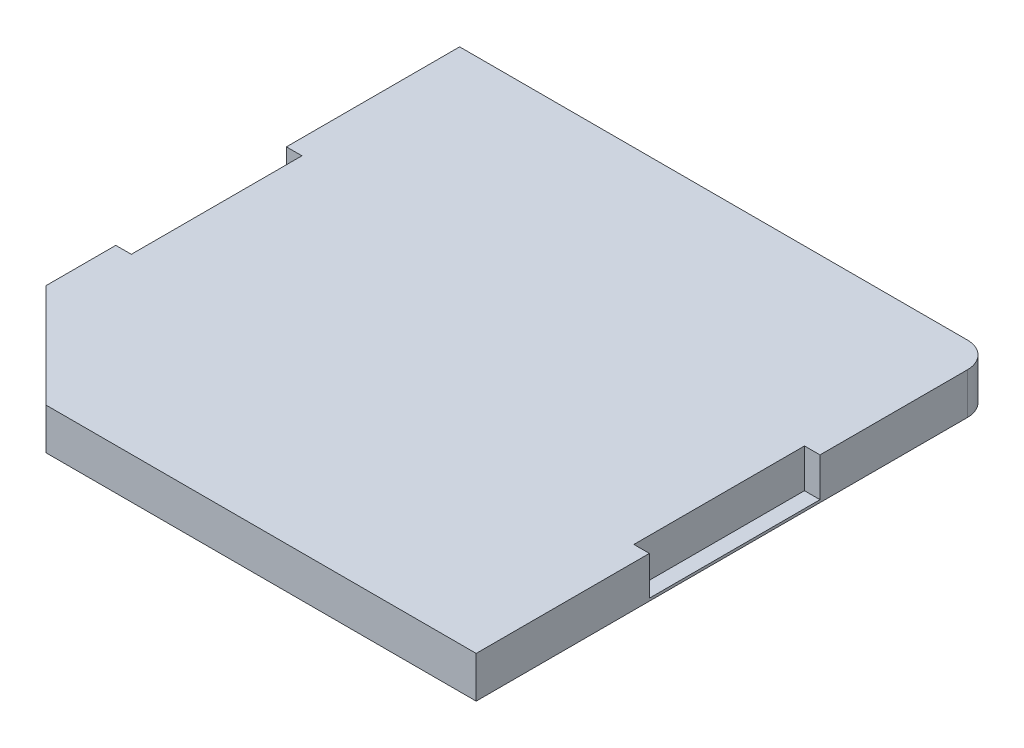
ISO-10303-21;
HEADER;
FILE_DESCRIPTION(('STEP AP214'),'2;1');
FILE_NAME('part.step','',(''),(''),'','','');
FILE_SCHEMA(('AUTOMOTIVE_DESIGN { 1 0 10303 214 1 1 1 1 }'));
ENDSEC;
DATA;
#1=APPLICATION_CONTEXT('core data for automotive mechanical design processes');
#2=APPLICATION_PROTOCOL_DEFINITION('international standard','automotive_design',2000,#1);
#3=PRODUCT_CONTEXT('',#1,'mechanical');
#4=PRODUCT('Part','Part','',(#3));
#5=PRODUCT_RELATED_PRODUCT_CATEGORY('part','',(#4));
#6=PRODUCT_DEFINITION_FORMATION('','',#4);
#7=PRODUCT_DEFINITION_CONTEXT('part definition',#1,'design');
#8=PRODUCT_DEFINITION('design','',#6,#7);
#9=PRODUCT_DEFINITION_SHAPE('','',#8);
#10=(LENGTH_UNIT() NAMED_UNIT(*) SI_UNIT(.MILLI.,.METRE.));
#11=(NAMED_UNIT(*) PLANE_ANGLE_UNIT() SI_UNIT($,.RADIAN.));
#12=(NAMED_UNIT(*) SI_UNIT($,.STERADIAN.) SOLID_ANGLE_UNIT());
#13=UNCERTAINTY_MEASURE_WITH_UNIT(LENGTH_MEASURE(1.E-05),#10,'distance_accuracy_value','');
#14=(GEOMETRIC_REPRESENTATION_CONTEXT(3) GLOBAL_UNCERTAINTY_ASSIGNED_CONTEXT((#13)) GLOBAL_UNIT_ASSIGNED_CONTEXT((#10,
#11,#12)) REPRESENTATION_CONTEXT('',''));
#15=CARTESIAN_POINT('',(0.,0.,0.));
#16=DIRECTION('',(0.,0.,1.));
#17=DIRECTION('',(1.,0.,0.));
#18=AXIS2_PLACEMENT_3D('',#15,#16,#17);
#19=CARTESIAN_POINT('',(28.99,3.22,5.7));
#20=DIRECTION('',(-1.,0.,0.));
#21=DIRECTION('',(0.,0.,1.));
#22=AXIS2_PLACEMENT_3D('',#19,#20,#21);
#23=PLANE('',#22);
#24=DIRECTION('',(0.,1.,0.));
#25=VECTOR('',#24,1.);
#26=CARTESIAN_POINT('',(28.99,1.57,7.35));
#27=LINE('',#26,#25);
#28=CARTESIAN_POINT('',(28.99,2.32,7.35));
#29=VERTEX_POINT('',#28);
#30=CARTESIAN_POINT('',(28.99,1.57,7.35));
#31=VERTEX_POINT('',#30);
#32=EDGE_CURVE('E184',#29,#31,#27,.F.);
#33=ORIENTED_EDGE('',*,*,#32,.T.);
#34=DIRECTION('',(0.,0.,-1.));
#35=VECTOR('',#34,1.);
#36=CARTESIAN_POINT('',(28.99,1.57,4.05));
#37=LINE('',#36,#35);
#38=CARTESIAN_POINT('',(28.99,1.57,4.05));
#39=VERTEX_POINT('',#38);
#40=EDGE_CURVE('E193',#31,#39,#37,.T.);
#41=ORIENTED_EDGE('',*,*,#40,.T.);
#42=DIRECTION('',(0.,1.,0.));
#43=VECTOR('',#42,1.);
#44=CARTESIAN_POINT('',(28.99,4.87,4.05));
#45=LINE('',#44,#43);
#46=CARTESIAN_POINT('',(28.99,2.32,4.05));
#47=VERTEX_POINT('',#46);
#48=EDGE_CURVE('E226',#39,#47,#45,.T.);
#49=ORIENTED_EDGE('',*,*,#48,.T.);
#50=DIRECTION('',(0.,0.,1.));
#51=VECTOR('',#50,1.);
#52=CARTESIAN_POINT('',(28.99,2.32,5.7));
#53=LINE('',#52,#51);
#54=EDGE_CURVE('E153',#29,#47,#53,.F.);
#55=ORIENTED_EDGE('',*,*,#54,.F.);
#56=EDGE_LOOP('',(#33,#41,#49,#55));
#57=FACE_BOUND('',#56,.T.);
#58=ADVANCED_FACE('F17',(#57),#23,.F.);
#59=CARTESIAN_POINT('',(19.27,3.22,5.7));
#60=DIRECTION('',(1.,0.,0.));
#61=DIRECTION('',(0.,0.,-1.));
#62=AXIS2_PLACEMENT_3D('',#59,#60,#61);
#63=PLANE('',#62);
#64=DIRECTION('',(0.,1.,0.));
#65=VECTOR('',#64,1.);
#66=CARTESIAN_POINT('',(19.27,1.57,4.05));
#67=LINE('',#66,#65);
#68=CARTESIAN_POINT('',(19.27,2.32,4.05));
#69=VERTEX_POINT('',#68);
#70=CARTESIAN_POINT('',(19.27,1.57,4.05));
#71=VERTEX_POINT('',#70);
#72=EDGE_CURVE('E227',#69,#71,#67,.F.);
#73=ORIENTED_EDGE('',*,*,#72,.T.);
#74=DIRECTION('',(0.,0.,-1.));
#75=VECTOR('',#74,1.);
#76=CARTESIAN_POINT('',(19.27,1.57,7.35));
#77=LINE('',#76,#75);
#78=CARTESIAN_POINT('',(19.27,1.57,7.35));
#79=VERTEX_POINT('',#78);
#80=EDGE_CURVE('E236',#71,#79,#77,.F.);
#81=ORIENTED_EDGE('',*,*,#80,.T.);
#82=DIRECTION('',(0.,1.,0.));
#83=VECTOR('',#82,1.);
#84=CARTESIAN_POINT('',(19.27,4.87,7.35));
#85=LINE('',#84,#83);
#86=CARTESIAN_POINT('',(19.27,2.32,7.35));
#87=VERTEX_POINT('',#86);
#88=EDGE_CURVE('E258',#79,#87,#85,.T.);
#89=ORIENTED_EDGE('',*,*,#88,.T.);
#90=DIRECTION('',(0.,0.,1.));
#91=VECTOR('',#90,1.);
#92=CARTESIAN_POINT('',(19.27,2.32,5.7));
#93=LINE('',#92,#91);
#94=EDGE_CURVE('E134',#69,#87,#93,.T.);
#95=ORIENTED_EDGE('',*,*,#94,.F.);
#96=EDGE_LOOP('',(#73,#81,#89,#95));
#97=FACE_BOUND('',#96,.T.);
#98=ADVANCED_FACE('F327',(#97),#63,.F.);
#99=CARTESIAN_POINT('',(18.97,4.87,7.35));
#100=DIRECTION('',(0.,0.,1.));
#101=DIRECTION('',(1.,0.,0.));
#102=AXIS2_PLACEMENT_3D('',#99,#100,#101);
#103=PLANE('',#102);
#104=ORIENTED_EDGE('',*,*,#88,.F.);
#105=DIRECTION('',(1.,0.,0.));
#106=VECTOR('',#105,1.);
#107=CARTESIAN_POINT('',(18.97,1.57,7.35));
#108=LINE('',#107,#106);
#109=CARTESIAN_POINT('',(18.97,1.57,7.35));
#110=VERTEX_POINT('',#109);
#111=EDGE_CURVE('E233',#79,#110,#108,.F.);
#112=ORIENTED_EDGE('',*,*,#111,.T.);
#113=DIRECTION('',(0.,1.,0.));
#114=VECTOR('',#113,1.);
#115=CARTESIAN_POINT('',(18.97,1.52,7.35));
#116=LINE('',#115,#114);
#117=CARTESIAN_POINT('',(18.97,2.32,7.35));
#118=VERTEX_POINT('',#117);
#119=EDGE_CURVE('E138',#118,#110,#116,.F.);
#120=ORIENTED_EDGE('',*,*,#119,.F.);
#121=DIRECTION('',(1.,0.,0.));
#122=VECTOR('',#121,1.);
#123=CARTESIAN_POINT('',(24.13,2.32,7.35));
#124=LINE('',#123,#122);
#125=EDGE_CURVE('E175',#87,#118,#124,.F.);
#126=ORIENTED_EDGE('',*,*,#125,.F.);
#127=EDGE_LOOP('',(#104,#112,#120,#126));
#128=FACE_BOUND('',#127,.T.);
#129=ADVANCED_FACE('F315',(#128),#103,.F.);
#130=CARTESIAN_POINT('',(18.97,1.57,7.35));
#131=DIRECTION('',(0.,-1.,0.));
#132=DIRECTION('',(0.,0.,-1.));
#133=AXIS2_PLACEMENT_3D('',#130,#131,#132);
#134=PLANE('',#133);
#135=ORIENTED_EDGE('',*,*,#111,.F.);
#136=ORIENTED_EDGE('',*,*,#80,.F.);
#137=DIRECTION('',(-1.,0.,0.));
#138=VECTOR('',#137,1.);
#139=CARTESIAN_POINT('',(18.97,1.57,4.05));
#140=LINE('',#139,#138);
#141=CARTESIAN_POINT('',(18.97,1.57,4.05));
#142=VERTEX_POINT('',#141);
#143=EDGE_CURVE('E223',#71,#142,#140,.T.);
#144=ORIENTED_EDGE('',*,*,#143,.T.);
#145=DIRECTION('',(0.,0.,1.));
#146=VECTOR('',#145,1.);
#147=CARTESIAN_POINT('',(18.97,1.57,0.7));
#148=LINE('',#147,#146);
#149=EDGE_CURVE('E140',#110,#142,#148,.F.);
#150=ORIENTED_EDGE('',*,*,#149,.F.);
#151=EDGE_LOOP('',(#135,#136,#144,#150));
#152=FACE_BOUND('',#151,.T.);
#153=ADVANCED_FACE('F319',(#152),#134,.F.);
#154=CARTESIAN_POINT('',(18.97,1.57,4.05));
#155=DIRECTION('',(0.,0.,-1.));
#156=DIRECTION('',(-1.,0.,0.));
#157=AXIS2_PLACEMENT_3D('',#154,#155,#156);
#158=PLANE('',#157);
#159=DIRECTION('',(0.,1.,0.));
#160=VECTOR('',#159,1.);
#161=CARTESIAN_POINT('',(18.97,1.52,4.05));
#162=LINE('',#161,#160);
#163=CARTESIAN_POINT('',(18.97,2.32,4.05));
#164=VERTEX_POINT('',#163);
#165=EDGE_CURVE('E214',#142,#164,#162,.T.);
#166=ORIENTED_EDGE('',*,*,#165,.F.);
#167=ORIENTED_EDGE('',*,*,#143,.F.);
#168=ORIENTED_EDGE('',*,*,#72,.F.);
#169=DIRECTION('',(1.,0.,0.));
#170=VECTOR('',#169,1.);
#171=CARTESIAN_POINT('',(24.13,2.32,4.05));
#172=LINE('',#171,#170);
#173=EDGE_CURVE('E152',#164,#69,#172,.T.);
#174=ORIENTED_EDGE('',*,*,#173,.F.);
#175=EDGE_LOOP('',(#166,#167,#168,#174));
#176=FACE_BOUND('',#175,.T.);
#177=ADVANCED_FACE('F324',(#176),#158,.F.);
#178=CARTESIAN_POINT('',(29.29,4.87,4.05));
#179=DIRECTION('',(0.,0.,-1.));
#180=DIRECTION('',(-1.,0.,0.));
#181=AXIS2_PLACEMENT_3D('',#178,#179,#180);
#182=PLANE('',#181);
#183=ORIENTED_EDGE('',*,*,#48,.F.);
#184=DIRECTION('',(1.,0.,0.));
#185=VECTOR('',#184,1.);
#186=CARTESIAN_POINT('',(29.29,1.57,4.05));
#187=LINE('',#186,#185);
#188=CARTESIAN_POINT('',(29.29,1.57,4.05));
#189=VERTEX_POINT('',#188);
#190=EDGE_CURVE('E190',#39,#189,#187,.T.);
#191=ORIENTED_EDGE('',*,*,#190,.T.);
#192=DIRECTION('',(0.,1.,0.));
#193=VECTOR('',#192,1.);
#194=CARTESIAN_POINT('',(29.29,1.52,4.05));
#195=LINE('',#194,#193);
#196=CARTESIAN_POINT('',(29.29,2.32,4.05));
#197=VERTEX_POINT('',#196);
#198=EDGE_CURVE('E156',#197,#189,#195,.F.);
#199=ORIENTED_EDGE('',*,*,#198,.F.);
#200=DIRECTION('',(1.,0.,0.));
#201=VECTOR('',#200,1.);
#202=CARTESIAN_POINT('',(24.13,2.32,4.05));
#203=LINE('',#202,#201);
#204=EDGE_CURVE('E150',#47,#197,#203,.T.);
#205=ORIENTED_EDGE('',*,*,#204,.F.);
#206=EDGE_LOOP('',(#183,#191,#199,#205));
#207=FACE_BOUND('',#206,.T.);
#208=ADVANCED_FACE('F365',(#207),#182,.F.);
#209=CARTESIAN_POINT('',(29.29,1.57,4.05));
#210=DIRECTION('',(0.,-1.,0.));
#211=DIRECTION('',(0.,0.,-1.));
#212=AXIS2_PLACEMENT_3D('',#209,#210,#211);
#213=PLANE('',#212);
#214=ORIENTED_EDGE('',*,*,#190,.F.);
#215=ORIENTED_EDGE('',*,*,#40,.F.);
#216=DIRECTION('',(1.,0.,0.));
#217=VECTOR('',#216,1.);
#218=CARTESIAN_POINT('',(29.29,1.57,7.35));
#219=LINE('',#218,#217);
#220=CARTESIAN_POINT('',(29.29,1.57,7.35));
#221=VERTEX_POINT('',#220);
#222=EDGE_CURVE('E181',#31,#221,#219,.T.);
#223=ORIENTED_EDGE('',*,*,#222,.T.);
#224=DIRECTION('',(0.,0.,-1.));
#225=VECTOR('',#224,1.);
#226=CARTESIAN_POINT('',(29.29,1.57,10.7));
#227=LINE('',#226,#225);
#228=EDGE_CURVE('E158',#189,#221,#227,.F.);
#229=ORIENTED_EDGE('',*,*,#228,.F.);
#230=EDGE_LOOP('',(#214,#215,#223,#229));
#231=FACE_BOUND('',#230,.T.);
#232=ADVANCED_FACE('F361',(#231),#213,.F.);
#233=CARTESIAN_POINT('',(29.29,1.57,7.35));
#234=DIRECTION('',(0.,0.,1.));
#235=DIRECTION('',(1.,0.,0.));
#236=AXIS2_PLACEMENT_3D('',#233,#234,#235);
#237=PLANE('',#236);
#238=DIRECTION('',(0.,1.,0.));
#239=VECTOR('',#238,1.);
#240=CARTESIAN_POINT('',(29.29,1.52,7.35));
#241=LINE('',#240,#239);
#242=CARTESIAN_POINT('',(29.29,2.32,7.35));
#243=VERTEX_POINT('',#242);
#244=EDGE_CURVE('E169',#221,#243,#241,.T.);
#245=ORIENTED_EDGE('',*,*,#244,.F.);
#246=ORIENTED_EDGE('',*,*,#222,.F.);
#247=ORIENTED_EDGE('',*,*,#32,.F.);
#248=DIRECTION('',(1.,0.,0.));
#249=VECTOR('',#248,1.);
#250=CARTESIAN_POINT('',(24.13,2.32,7.35));
#251=LINE('',#250,#249);
#252=EDGE_CURVE('E172',#243,#29,#251,.F.);
#253=ORIENTED_EDGE('',*,*,#252,.F.);
#254=EDGE_LOOP('',(#245,#246,#247,#253));
#255=FACE_BOUND('',#254,.T.);
#256=ADVANCED_FACE('F358',(#255),#237,.F.);
#257=CARTESIAN_POINT('',(24.13,2.32,5.7));
#258=DIRECTION('',(0.,1.,0.));
#259=DIRECTION('',(0.,0.,1.));
#260=AXIS2_PLACEMENT_3D('',#257,#258,#259);
#261=PLANE('',#260);
#262=ORIENTED_EDGE('',*,*,#173,.T.);
#263=ORIENTED_EDGE('',*,*,#94,.T.);
#264=ORIENTED_EDGE('',*,*,#125,.T.);
#265=DIRECTION('',(0.,0.,1.));
#266=VECTOR('',#265,1.);
#267=CARTESIAN_POINT('',(18.97,2.32,0.7));
#268=LINE('',#267,#266);
#269=CARTESIAN_POINT('',(18.97,2.32,8.7));
#270=VERTEX_POINT('',#269);
#271=EDGE_CURVE('E198',#270,#118,#268,.F.);
#272=ORIENTED_EDGE('',*,*,#271,.F.);
#273=DIRECTION('',(0.707106781186548,0.,0.707106781186548));
#274=VECTOR('',#273,1.);
#275=CARTESIAN_POINT('',(18.97,2.32,8.7));
#276=LINE('',#275,#274);
#277=CARTESIAN_POINT('',(20.97,2.32,10.7));
#278=VERTEX_POINT('',#277);
#279=EDGE_CURVE('E196',#278,#270,#276,.F.);
#280=ORIENTED_EDGE('',*,*,#279,.F.);
#281=DIRECTION('',(1.,0.,0.));
#282=VECTOR('',#281,1.);
#283=CARTESIAN_POINT('',(20.97,2.32,10.7));
#284=LINE('',#283,#282);
#285=CARTESIAN_POINT('',(29.29,2.32,10.7));
#286=VERTEX_POINT('',#285);
#287=EDGE_CURVE('E162',#286,#278,#284,.F.);
#288=ORIENTED_EDGE('',*,*,#287,.F.);
#289=DIRECTION('',(0.,0.,-1.));
#290=VECTOR('',#289,1.);
#291=CARTESIAN_POINT('',(29.29,2.32,10.7));
#292=LINE('',#291,#290);
#293=EDGE_CURVE('E167',#243,#286,#292,.F.);
#294=ORIENTED_EDGE('',*,*,#293,.F.);
#295=ORIENTED_EDGE('',*,*,#252,.T.);
#296=ORIENTED_EDGE('',*,*,#54,.T.);
#297=ORIENTED_EDGE('',*,*,#204,.T.);
#298=DIRECTION('',(0.,0.,-1.));
#299=VECTOR('',#298,1.);
#300=CARTESIAN_POINT('',(29.29,2.32,10.7));
#301=LINE('',#300,#299);
#302=CARTESIAN_POINT('',(29.29,2.32,1.2));
#303=VERTEX_POINT('',#302);
#304=EDGE_CURVE('E130',#303,#197,#301,.F.);
#305=ORIENTED_EDGE('',*,*,#304,.F.);
#306=CARTESIAN_POINT('',(28.79,2.32,1.2));
#307=DIRECTION('',(0.,1.,0.));
#308=DIRECTION('',(0.,0.,1.));
#309=AXIS2_PLACEMENT_3D('',#306,#307,#308);
#310=CIRCLE('',#309,0.5);
#311=CARTESIAN_POINT('',(28.79,2.32,0.7));
#312=VERTEX_POINT('',#311);
#313=EDGE_CURVE('E20',#312,#303,#310,.F.);
#314=ORIENTED_EDGE('',*,*,#313,.F.);
#315=DIRECTION('',(-1.,0.,0.));
#316=VECTOR('',#315,1.);
#317=CARTESIAN_POINT('',(28.79,2.32,0.7));
#318=LINE('',#317,#316);
#319=CARTESIAN_POINT('',(18.97,2.32,0.700000000000001));
#320=VERTEX_POINT('',#319);
#321=EDGE_CURVE('E114',#320,#312,#318,.F.);
#322=ORIENTED_EDGE('',*,*,#321,.F.);
#323=DIRECTION('',(0.,0.,1.));
#324=VECTOR('',#323,1.);
#325=CARTESIAN_POINT('',(18.97,2.32,0.7));
#326=LINE('',#325,#324);
#327=EDGE_CURVE('E212',#164,#320,#326,.F.);
#328=ORIENTED_EDGE('',*,*,#327,.F.);
#329=EDGE_LOOP('',(#262,#263,#264,#272,#280,#288,#294,#295,#296,#297,#305,#314,#322,#328));
#330=FACE_BOUND('',#329,.T.);
#331=ADVANCED_FACE('F128',(#330),#261,.T.);
#332=CARTESIAN_POINT('',(28.79,1.52,1.2));
#333=DIRECTION('',(0.,1.,0.));
#334=DIRECTION('',(0.,0.,1.));
#335=AXIS2_PLACEMENT_3D('',#332,#333,#334);
#336=CYLINDRICAL_SURFACE('',#335,0.5);
#337=ORIENTED_EDGE('',*,*,#313,.T.);
#338=DIRECTION('',(0.,1.,0.));
#339=VECTOR('',#338,1.);
#340=CARTESIAN_POINT('',(29.29,1.52,1.2));
#341=LINE('',#340,#339);
#342=CARTESIAN_POINT('',(29.29,1.52,1.2));
#343=VERTEX_POINT('',#342);
#344=EDGE_CURVE('E147',#343,#303,#341,.T.);
#345=ORIENTED_EDGE('',*,*,#344,.F.);
#346=CARTESIAN_POINT('',(28.79,1.52,1.2));
#347=DIRECTION('',(0.,1.,0.));
#348=DIRECTION('',(0.,0.,1.));
#349=AXIS2_PLACEMENT_3D('',#346,#347,#348);
#350=CIRCLE('',#349,0.5);
#351=CARTESIAN_POINT('',(28.79,1.52,0.7));
#352=VERTEX_POINT('',#351);
#353=EDGE_CURVE('E137',#343,#352,#350,.T.);
#354=ORIENTED_EDGE('',*,*,#353,.T.);
#355=DIRECTION('',(0.,1.,0.));
#356=VECTOR('',#355,1.);
#357=CARTESIAN_POINT('',(28.79,1.52,0.7));
#358=LINE('',#357,#356);
#359=EDGE_CURVE('E119',#312,#352,#358,.F.);
#360=ORIENTED_EDGE('',*,*,#359,.F.);
#361=EDGE_LOOP('',(#337,#345,#354,#360));
#362=FACE_BOUND('',#361,.T.);
#363=ADVANCED_FACE('F136',(#362),#336,.T.);
#364=CARTESIAN_POINT('',(28.79,1.52,0.7));
#365=DIRECTION('',(0.,0.,-1.));
#366=DIRECTION('',(-1.,0.,0.));
#367=AXIS2_PLACEMENT_3D('',#364,#365,#366);
#368=PLANE('',#367);
#369=ORIENTED_EDGE('',*,*,#321,.T.);
#370=ORIENTED_EDGE('',*,*,#359,.T.);
#371=DIRECTION('',(1.,0.,0.));
#372=VECTOR('',#371,1.);
#373=CARTESIAN_POINT('',(24.13,1.52,0.7));
#374=LINE('',#373,#372);
#375=CARTESIAN_POINT('',(18.97,1.52,0.7));
#376=VERTEX_POINT('',#375);
#377=EDGE_CURVE('E269',#352,#376,#374,.F.);
#378=ORIENTED_EDGE('',*,*,#377,.T.);
#379=DIRECTION('',(0.,1.,0.));
#380=VECTOR('',#379,1.);
#381=CARTESIAN_POINT('',(18.97,1.52,0.7));
#382=LINE('',#381,#380);
#383=EDGE_CURVE('E121',#320,#376,#382,.F.);
#384=ORIENTED_EDGE('',*,*,#383,.F.);
#385=EDGE_LOOP('',(#369,#370,#378,#384));
#386=FACE_BOUND('',#385,.T.);
#387=ADVANCED_FACE('F116',(#386),#368,.T.);
#388=CARTESIAN_POINT('',(18.97,1.52,0.7));
#389=DIRECTION('',(-1.,0.,0.));
#390=DIRECTION('',(0.,0.,1.));
#391=AXIS2_PLACEMENT_3D('',#388,#389,#390);
#392=PLANE('',#391);
#393=DIRECTION('',(0.,1.,0.));
#394=VECTOR('',#393,1.);
#395=CARTESIAN_POINT('',(18.97,1.52,8.7));
#396=LINE('',#395,#394);
#397=CARTESIAN_POINT('',(18.97,1.52,8.7));
#398=VERTEX_POINT('',#397);
#399=EDGE_CURVE('E164',#270,#398,#396,.F.);
#400=ORIENTED_EDGE('',*,*,#399,.F.);
#401=ORIENTED_EDGE('',*,*,#271,.T.);
#402=ORIENTED_EDGE('',*,*,#119,.T.);
#403=ORIENTED_EDGE('',*,*,#149,.T.);
#404=ORIENTED_EDGE('',*,*,#165,.T.);
#405=ORIENTED_EDGE('',*,*,#327,.T.);
#406=ORIENTED_EDGE('',*,*,#383,.T.);
#407=DIRECTION('',(0.,0.,1.));
#408=VECTOR('',#407,1.);
#409=CARTESIAN_POINT('',(18.97,1.52,5.7));
#410=LINE('',#409,#408);
#411=EDGE_CURVE('E270',#376,#398,#410,.T.);
#412=ORIENTED_EDGE('',*,*,#411,.T.);
#413=EDGE_LOOP('',(#400,#401,#402,#403,#404,#405,#406,#412));
#414=FACE_BOUND('',#413,.T.);
#415=ADVANCED_FACE('F302',(#414),#392,.T.);
#416=CARTESIAN_POINT('',(18.97,1.52,8.7));
#417=DIRECTION('',(-0.707106781186548,0.,0.707106781186548));
#418=DIRECTION('',(0.707106781186548,0.,0.707106781186548));
#419=AXIS2_PLACEMENT_3D('',#416,#417,#418);
#420=PLANE('',#419);
#421=ORIENTED_EDGE('',*,*,#279,.T.);
#422=ORIENTED_EDGE('',*,*,#399,.T.);
#423=DIRECTION('',(0.707106781186547,0.,0.707106781186548));
#424=VECTOR('',#423,1.);
#425=CARTESIAN_POINT('',(18.97,1.52,8.7));
#426=LINE('',#425,#424);
#427=CARTESIAN_POINT('',(20.97,1.52,10.7));
#428=VERTEX_POINT('',#427);
#429=EDGE_CURVE('E273',#398,#428,#426,.T.);
#430=ORIENTED_EDGE('',*,*,#429,.T.);
#431=DIRECTION('',(0.,1.,0.));
#432=VECTOR('',#431,1.);
#433=CARTESIAN_POINT('',(20.97,1.52,10.7));
#434=LINE('',#433,#432);
#435=EDGE_CURVE('E159',#278,#428,#434,.F.);
#436=ORIENTED_EDGE('',*,*,#435,.F.);
#437=EDGE_LOOP('',(#421,#422,#430,#436));
#438=FACE_BOUND('',#437,.T.);
#439=ADVANCED_FACE('F309',(#438),#420,.T.);
#440=CARTESIAN_POINT('',(20.97,1.52,10.7));
#441=DIRECTION('',(0.,0.,1.));
#442=DIRECTION('',(1.,0.,0.));
#443=AXIS2_PLACEMENT_3D('',#440,#441,#442);
#444=PLANE('',#443);
#445=ORIENTED_EDGE('',*,*,#287,.T.);
#446=ORIENTED_EDGE('',*,*,#435,.T.);
#447=DIRECTION('',(1.,0.,0.));
#448=VECTOR('',#447,1.);
#449=CARTESIAN_POINT('',(24.13,1.52,10.7));
#450=LINE('',#449,#448);
#451=CARTESIAN_POINT('',(29.29,1.52,10.7));
#452=VERTEX_POINT('',#451);
#453=EDGE_CURVE('E26',#428,#452,#450,.T.);
#454=ORIENTED_EDGE('',*,*,#453,.T.);
#455=DIRECTION('',(0.,1.,0.));
#456=VECTOR('',#455,1.);
#457=CARTESIAN_POINT('',(29.29,1.52,10.7));
#458=LINE('',#457,#456);
#459=EDGE_CURVE('E34',#286,#452,#458,.F.);
#460=ORIENTED_EDGE('',*,*,#459,.F.);
#461=EDGE_LOOP('',(#445,#446,#454,#460));
#462=FACE_BOUND('',#461,.T.);
#463=ADVANCED_FACE('F342',(#462),#444,.T.);
#464=CARTESIAN_POINT('',(29.29,1.52,10.7));
#465=DIRECTION('',(1.,0.,0.));
#466=DIRECTION('',(0.,0.,-1.));
#467=AXIS2_PLACEMENT_3D('',#464,#465,#466);
#468=PLANE('',#467);
#469=ORIENTED_EDGE('',*,*,#344,.T.);
#470=ORIENTED_EDGE('',*,*,#304,.T.);
#471=ORIENTED_EDGE('',*,*,#198,.T.);
#472=ORIENTED_EDGE('',*,*,#228,.T.);
#473=ORIENTED_EDGE('',*,*,#244,.T.);
#474=ORIENTED_EDGE('',*,*,#293,.T.);
#475=ORIENTED_EDGE('',*,*,#459,.T.);
#476=DIRECTION('',(0.,0.,1.));
#477=VECTOR('',#476,1.);
#478=CARTESIAN_POINT('',(29.29,1.52,5.7));
#479=LINE('',#478,#477);
#480=EDGE_CURVE('E11',#452,#343,#479,.F.);
#481=ORIENTED_EDGE('',*,*,#480,.T.);
#482=EDGE_LOOP('',(#469,#470,#471,#472,#473,#474,#475,#481));
#483=FACE_BOUND('',#482,.T.);
#484=ADVANCED_FACE('F337',(#483),#468,.T.);
#485=CARTESIAN_POINT('',(24.13,1.52,5.7));
#486=DIRECTION('',(0.,1.,0.));
#487=DIRECTION('',(0.,0.,1.));
#488=AXIS2_PLACEMENT_3D('',#485,#486,#487);
#489=PLANE('',#488);
#490=ORIENTED_EDGE('',*,*,#453,.F.);
#491=ORIENTED_EDGE('',*,*,#429,.F.);
#492=ORIENTED_EDGE('',*,*,#411,.F.);
#493=ORIENTED_EDGE('',*,*,#377,.F.);
#494=ORIENTED_EDGE('',*,*,#353,.F.);
#495=ORIENTED_EDGE('',*,*,#480,.F.);
#496=EDGE_LOOP('',(#490,#491,#492,#493,#494,#495));
#497=FACE_BOUND('',#496,.T.);
#498=ADVANCED_FACE('F306',(#497),#489,.F.);
#499=CLOSED_SHELL('',(#58,#98,#129,#153,#177,#208,#232,#256,#331,#363,#387,#415,#439,#463,#484,#498));
#500=MANIFOLD_SOLID_BREP('B1',#499);
#501=ADVANCED_BREP_SHAPE_REPRESENTATION('',(#18,#500),#14);
#502=SHAPE_DEFINITION_REPRESENTATION(#9,#501);
ENDSEC;
END-ISO-10303-21;
